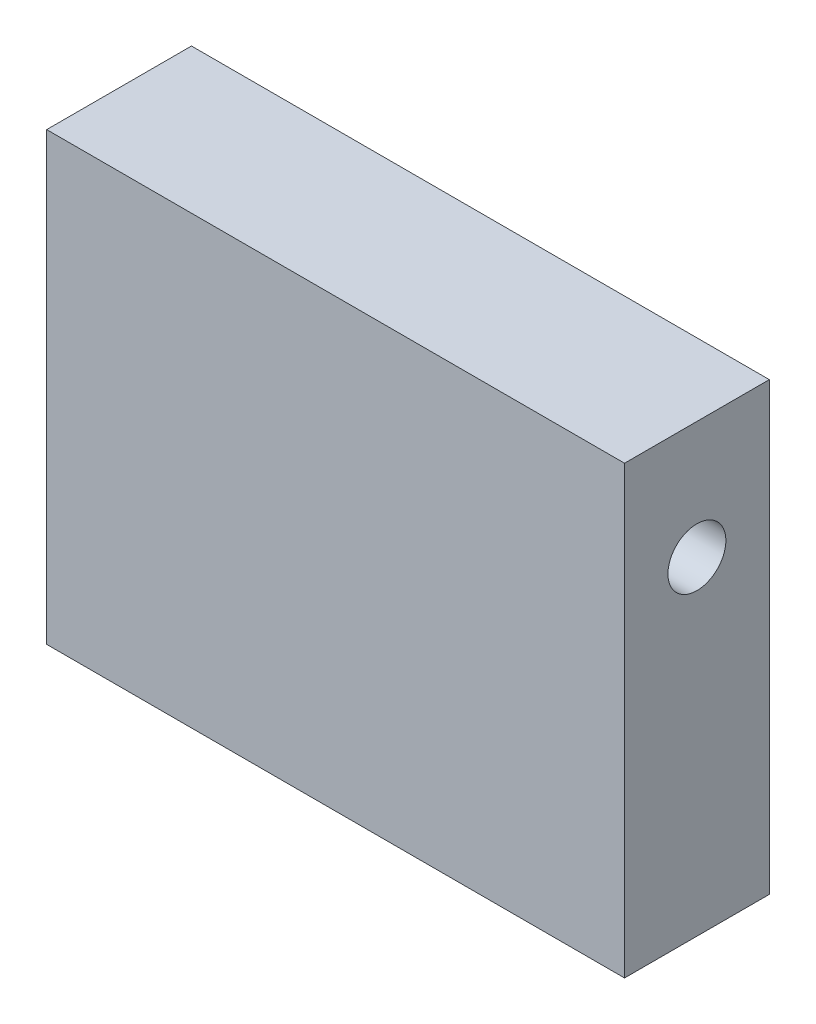
ISO-10303-21;
HEADER;
FILE_DESCRIPTION(('STEP AP214'),'2;1');
FILE_NAME('part.step','',(''),(''),'','','');
FILE_SCHEMA(('AUTOMOTIVE_DESIGN { 1 0 10303 214 1 1 1 1 }'));
ENDSEC;
DATA;
#1=APPLICATION_CONTEXT('core data for automotive mechanical design processes');
#2=APPLICATION_PROTOCOL_DEFINITION('international standard','automotive_design',2000,#1);
#3=PRODUCT_CONTEXT('',#1,'mechanical');
#4=PRODUCT('Part','Part','',(#3));
#5=PRODUCT_RELATED_PRODUCT_CATEGORY('part','',(#4));
#6=PRODUCT_DEFINITION_FORMATION('','',#4);
#7=PRODUCT_DEFINITION_CONTEXT('part definition',#1,'design');
#8=PRODUCT_DEFINITION('design','',#6,#7);
#9=PRODUCT_DEFINITION_SHAPE('','',#8);
#10=(LENGTH_UNIT() NAMED_UNIT(*) SI_UNIT(.MILLI.,.METRE.));
#11=(NAMED_UNIT(*) PLANE_ANGLE_UNIT() SI_UNIT($,.RADIAN.));
#12=(NAMED_UNIT(*) SI_UNIT($,.STERADIAN.) SOLID_ANGLE_UNIT());
#13=UNCERTAINTY_MEASURE_WITH_UNIT(LENGTH_MEASURE(1.E-05),#10,'distance_accuracy_value','');
#14=(GEOMETRIC_REPRESENTATION_CONTEXT(3) GLOBAL_UNCERTAINTY_ASSIGNED_CONTEXT((#13)) GLOBAL_UNIT_ASSIGNED_CONTEXT((#10,
#11,#12)) REPRESENTATION_CONTEXT('',''));
#15=CARTESIAN_POINT('',(0.,0.,0.));
#16=DIRECTION('',(0.,0.,1.));
#17=DIRECTION('',(1.,0.,0.));
#18=AXIS2_PLACEMENT_3D('',#15,#16,#17);
#19=CARTESIAN_POINT('',(-18.9438751867215,-50.4424985270397,20.));
#20=DIRECTION('',(-1.,0.,0.));
#21=DIRECTION('',(0.,0.,1.));
#22=AXIS2_PLACEMENT_3D('',#19,#20,#21);
#23=PLANE('',#22);
#24=CARTESIAN_POINT('',(-18.9438751867215,-5.10160207824872,10.));
#25=DIRECTION('',(-1.,0.,0.));
#26=DIRECTION('',(0.,0.,1.));
#27=AXIS2_PLACEMENT_3D('',#24,#25,#26);
#28=CIRCLE('',#27,4.);
#29=CARTESIAN_POINT('',(-18.9438751867215,-5.10160207824872,14.));
#30=VERTEX_POINT('',#29);
#31=EDGE_CURVE('E110',#30,#30,#28,.T.);
#32=ORIENTED_EDGE('',*,*,#31,.T.);
#33=EDGE_LOOP('',(#32));
#34=FACE_BOUND('',#33,.T.);
#35=DIRECTION('',(0.,1.,0.));
#36=VECTOR('',#35,1.);
#37=CARTESIAN_POINT('',(-18.9438751867215,-50.4424985270397,0.));
#38=LINE('',#37,#36);
#39=CARTESIAN_POINT('',(-18.9438751867215,-50.4424985270397,0.));
#40=VERTEX_POINT('',#39);
#41=CARTESIAN_POINT('',(-18.9438751867215,11.1381856803955,0.));
#42=VERTEX_POINT('',#41);
#43=EDGE_CURVE('E96',#40,#42,#38,.T.);
#44=ORIENTED_EDGE('',*,*,#43,.T.);
#45=DIRECTION('',(0.,0.,-1.));
#46=VECTOR('',#45,1.);
#47=CARTESIAN_POINT('',(-18.9438751867215,11.1381856803955,20.));
#48=LINE('',#47,#46);
#49=CARTESIAN_POINT('',(-18.9438751867215,11.1381856803955,20.));
#50=VERTEX_POINT('',#49);
#51=EDGE_CURVE('E11',#50,#42,#48,.T.);
#52=ORIENTED_EDGE('',*,*,#51,.F.);
#53=DIRECTION('',(0.,1.,0.));
#54=VECTOR('',#53,1.);
#55=CARTESIAN_POINT('',(-18.9438751867215,-50.4424985270397,20.));
#56=LINE('',#55,#54);
#57=CARTESIAN_POINT('',(-18.9438751867215,-50.4424985270397,20.));
#58=VERTEX_POINT('',#57);
#59=EDGE_CURVE('E84',#58,#50,#56,.T.);
#60=ORIENTED_EDGE('',*,*,#59,.F.);
#61=DIRECTION('',(0.,0.,-1.));
#62=VECTOR('',#61,1.);
#63=CARTESIAN_POINT('',(-18.9438751867215,-50.4424985270397,20.));
#64=LINE('',#63,#62);
#65=EDGE_CURVE('E92',#58,#40,#64,.T.);
#66=ORIENTED_EDGE('',*,*,#65,.T.);
#67=EDGE_LOOP('',(#44,#52,#60,#66));
#68=FACE_BOUND('',#67,.T.);
#69=ADVANCED_FACE('F33',(#34,#68),#23,.F.);
#70=CARTESIAN_POINT('',(-98.7604795144605,11.1381856803955,20.));
#71=DIRECTION('',(0.,-1.,0.));
#72=DIRECTION('',(0.,0.,-1.));
#73=AXIS2_PLACEMENT_3D('',#70,#71,#72);
#74=PLANE('',#73);
#75=DIRECTION('',(-1.,0.,0.));
#76=VECTOR('',#75,1.);
#77=CARTESIAN_POINT('',(-98.7604795144605,11.1381856803955,0.));
#78=LINE('',#77,#76);
#79=CARTESIAN_POINT('',(-98.7604795144605,11.1381856803955,0.));
#80=VERTEX_POINT('',#79);
#81=EDGE_CURVE('E88',#42,#80,#78,.T.);
#82=ORIENTED_EDGE('',*,*,#81,.T.);
#83=DIRECTION('',(0.,0.,-1.));
#84=VECTOR('',#83,1.);
#85=CARTESIAN_POINT('',(-98.7604795144605,11.1381856803955,20.));
#86=LINE('',#85,#84);
#87=CARTESIAN_POINT('',(-98.7604795144605,11.1381856803955,20.));
#88=VERTEX_POINT('',#87);
#89=EDGE_CURVE('E41',#88,#80,#86,.T.);
#90=ORIENTED_EDGE('',*,*,#89,.F.);
#91=DIRECTION('',(-1.,0.,0.));
#92=VECTOR('',#91,1.);
#93=CARTESIAN_POINT('',(-98.7604795144605,11.1381856803955,20.));
#94=LINE('',#93,#92);
#95=EDGE_CURVE('E79',#50,#88,#94,.T.);
#96=ORIENTED_EDGE('',*,*,#95,.F.);
#97=ORIENTED_EDGE('',*,*,#51,.T.);
#98=EDGE_LOOP('',(#82,#90,#96,#97));
#99=FACE_BOUND('',#98,.T.);
#100=ADVANCED_FACE('F87',(#99),#74,.F.);
#101=CARTESIAN_POINT('',(-98.7604795144605,-50.4424985270397,20.));
#102=DIRECTION('',(1.,0.,0.));
#103=DIRECTION('',(0.,0.,-1.));
#104=AXIS2_PLACEMENT_3D('',#101,#102,#103);
#105=PLANE('',#104);
#106=CARTESIAN_POINT('',(-98.7604795144605,-5.10160207824872,10.));
#107=DIRECTION('',(-1.,0.,0.));
#108=DIRECTION('',(0.,0.,1.));
#109=AXIS2_PLACEMENT_3D('',#106,#107,#108);
#110=CIRCLE('',#109,4.);
#111=CARTESIAN_POINT('',(-98.7604795144605,-5.10160207824872,14.));
#112=VERTEX_POINT('',#111);
#113=EDGE_CURVE('E99',#112,#112,#110,.T.);
#114=ORIENTED_EDGE('',*,*,#113,.F.);
#115=EDGE_LOOP('',(#114));
#116=FACE_BOUND('',#115,.T.);
#117=DIRECTION('',(0.,-1.,0.));
#118=VECTOR('',#117,1.);
#119=CARTESIAN_POINT('',(-98.7604795144605,-50.4424985270397,0.));
#120=LINE('',#119,#118);
#121=CARTESIAN_POINT('',(-98.7604795144605,-50.4424985270397,0.));
#122=VERTEX_POINT('',#121);
#123=EDGE_CURVE('E66',#80,#122,#120,.T.);
#124=ORIENTED_EDGE('',*,*,#123,.T.);
#125=DIRECTION('',(0.,0.,-1.));
#126=VECTOR('',#125,1.);
#127=CARTESIAN_POINT('',(-98.7604795144605,-50.4424985270397,20.));
#128=LINE('',#127,#126);
#129=CARTESIAN_POINT('',(-98.7604795144605,-50.4424985270397,20.));
#130=VERTEX_POINT('',#129);
#131=EDGE_CURVE('E89',#130,#122,#128,.T.);
#132=ORIENTED_EDGE('',*,*,#131,.F.);
#133=DIRECTION('',(0.,-1.,0.));
#134=VECTOR('',#133,1.);
#135=CARTESIAN_POINT('',(-98.7604795144605,-50.4424985270397,20.));
#136=LINE('',#135,#134);
#137=EDGE_CURVE('E82',#88,#130,#136,.T.);
#138=ORIENTED_EDGE('',*,*,#137,.F.);
#139=ORIENTED_EDGE('',*,*,#89,.T.);
#140=EDGE_LOOP('',(#124,#132,#138,#139));
#141=FACE_BOUND('',#140,.T.);
#142=ADVANCED_FACE('F90',(#116,#141),#105,.F.);
#143=CARTESIAN_POINT('',(-98.7604795144605,-50.4424985270397,20.));
#144=DIRECTION('',(0.,1.,0.));
#145=DIRECTION('',(0.,0.,1.));
#146=AXIS2_PLACEMENT_3D('',#143,#144,#145);
#147=PLANE('',#146);
#148=DIRECTION('',(1.,0.,0.));
#149=VECTOR('',#148,1.);
#150=CARTESIAN_POINT('',(-98.7604795144605,-50.4424985270397,0.));
#151=LINE('',#150,#149);
#152=EDGE_CURVE('E72',#122,#40,#151,.T.);
#153=ORIENTED_EDGE('',*,*,#152,.T.);
#154=ORIENTED_EDGE('',*,*,#65,.F.);
#155=DIRECTION('',(1.,0.,0.));
#156=VECTOR('',#155,1.);
#157=CARTESIAN_POINT('',(-98.7604795144605,-50.4424985270397,20.));
#158=LINE('',#157,#156);
#159=EDGE_CURVE('E49',#130,#58,#158,.T.);
#160=ORIENTED_EDGE('',*,*,#159,.F.);
#161=ORIENTED_EDGE('',*,*,#131,.T.);
#162=EDGE_LOOP('',(#153,#154,#160,#161));
#163=FACE_BOUND('',#162,.T.);
#164=ADVANCED_FACE('F104',(#163),#147,.F.);
#165=CARTESIAN_POINT('',(0.,0.,20.));
#166=DIRECTION('',(0.,0.,-1.));
#167=DIRECTION('',(-1.,0.,0.));
#168=AXIS2_PLACEMENT_3D('',#165,#166,#167);
#169=PLANE('',#168);
#170=ORIENTED_EDGE('',*,*,#59,.T.);
#171=ORIENTED_EDGE('',*,*,#95,.T.);
#172=ORIENTED_EDGE('',*,*,#137,.T.);
#173=ORIENTED_EDGE('',*,*,#159,.T.);
#174=EDGE_LOOP('',(#170,#171,#172,#173));
#175=FACE_BOUND('',#174,.T.);
#176=ADVANCED_FACE('F80',(#175),#169,.F.);
#177=CARTESIAN_POINT('',(0.,0.,0.));
#178=DIRECTION('',(0.,0.,-1.));
#179=DIRECTION('',(-1.,0.,0.));
#180=AXIS2_PLACEMENT_3D('',#177,#178,#179);
#181=PLANE('',#180);
#182=ORIENTED_EDGE('',*,*,#43,.F.);
#183=ORIENTED_EDGE('',*,*,#152,.F.);
#184=ORIENTED_EDGE('',*,*,#123,.F.);
#185=ORIENTED_EDGE('',*,*,#81,.F.);
#186=EDGE_LOOP('',(#182,#183,#184,#185));
#187=FACE_BOUND('',#186,.T.);
#188=ADVANCED_FACE('F107',(#187),#181,.T.);
#189=CARTESIAN_POINT('',(-98.7604795144605,-5.10160207824872,10.));
#190=DIRECTION('',(1.,0.,0.));
#191=DIRECTION('',(0.,0.,-1.));
#192=AXIS2_PLACEMENT_3D('',#189,#190,#191);
#193=CYLINDRICAL_SURFACE('',#192,4.);
#194=ORIENTED_EDGE('',*,*,#113,.T.);
#195=EDGE_LOOP('',(#194));
#196=FACE_BOUND('',#195,.T.);
#197=ORIENTED_EDGE('',*,*,#31,.F.);
#198=EDGE_LOOP('',(#197));
#199=FACE_BOUND('',#198,.T.);
#200=ADVANCED_FACE('F116',(#196,#199),#193,.F.);
#201=CLOSED_SHELL('',(#69,#100,#142,#164,#176,#188,#200));
#202=MANIFOLD_SOLID_BREP('B2',#201);
#203=ADVANCED_BREP_SHAPE_REPRESENTATION('',(#18,#202),#14);
#204=SHAPE_DEFINITION_REPRESENTATION(#9,#203);
ENDSEC;
END-ISO-10303-21;
